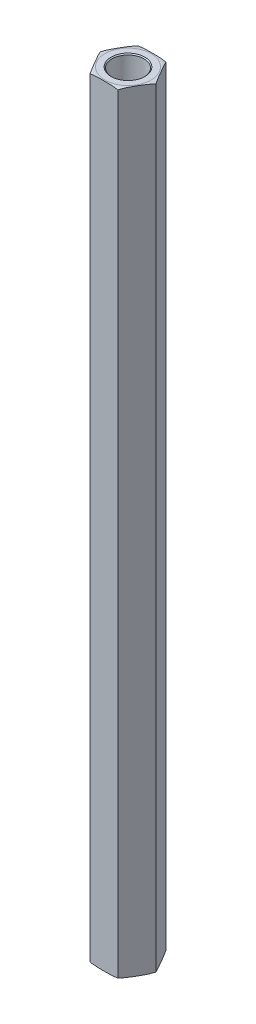
ISO-10303-21;
HEADER;
FILE_DESCRIPTION(('STEP AP214'),'2;1');
FILE_NAME('part.step','',(''),(''),'','','');
FILE_SCHEMA(('AUTOMOTIVE_DESIGN { 1 0 10303 214 1 1 1 1 }'));
ENDSEC;
DATA;
#1=APPLICATION_CONTEXT('core data for automotive mechanical design processes');
#2=APPLICATION_PROTOCOL_DEFINITION('international standard','automotive_design',2000,#1);
#3=PRODUCT_CONTEXT('',#1,'mechanical');
#4=PRODUCT('Part','Part','',(#3));
#5=PRODUCT_RELATED_PRODUCT_CATEGORY('part','',(#4));
#6=PRODUCT_DEFINITION_FORMATION('','',#4);
#7=PRODUCT_DEFINITION_CONTEXT('part definition',#1,'design');
#8=PRODUCT_DEFINITION('design','',#6,#7);
#9=PRODUCT_DEFINITION_SHAPE('','',#8);
#10=(LENGTH_UNIT() NAMED_UNIT(*) SI_UNIT(.MILLI.,.METRE.));
#11=(NAMED_UNIT(*) PLANE_ANGLE_UNIT() SI_UNIT($,.RADIAN.));
#12=(NAMED_UNIT(*) SI_UNIT($,.STERADIAN.) SOLID_ANGLE_UNIT());
#13=UNCERTAINTY_MEASURE_WITH_UNIT(LENGTH_MEASURE(1.E-05),#10,'distance_accuracy_value','');
#14=(GEOMETRIC_REPRESENTATION_CONTEXT(3) GLOBAL_UNCERTAINTY_ASSIGNED_CONTEXT((#13)) GLOBAL_UNIT_ASSIGNED_CONTEXT((#10,
#11,#12)) REPRESENTATION_CONTEXT('',''));
#15=CARTESIAN_POINT('',(0.,0.,0.));
#16=DIRECTION('',(0.,0.,1.));
#17=DIRECTION('',(1.,0.,0.));
#18=AXIS2_PLACEMENT_3D('',#15,#16,#17);
#19=CARTESIAN_POINT('',(0.,38.1,0.));
#20=DIRECTION('',(0.,1.,0.));
#21=DIRECTION('',(0.,0.,1.));
#22=AXIS2_PLACEMENT_3D('',#19,#20,#21);
#23=PLANE('',#22);
#24=CARTESIAN_POINT('',(0.,38.1,0.));
#25=DIRECTION('',(0.,1.,0.));
#26=DIRECTION('',(0.,0.,1.));
#27=AXIS2_PLACEMENT_3D('',#24,#25,#26);
#28=CIRCLE('',#27,2.0955);
#29=CARTESIAN_POINT('',(0.,38.1,2.0955));
#30=VERTEX_POINT('',#29);
#31=EDGE_CURVE('E278',#30,#30,#28,.T.);
#32=ORIENTED_EDGE('',*,*,#31,.T.);
#33=EDGE_LOOP('',(#32));
#34=FACE_BOUND('',#33,.T.);
#35=ADVANCED_FACE('F14',(#34),#23,.T.);
#36=CARTESIAN_POINT('',(0.,-38.1,0.));
#37=DIRECTION('',(0.,-1.,0.));
#38=DIRECTION('',(0.,0.,-1.));
#39=AXIS2_PLACEMENT_3D('',#36,#37,#38);
#40=PLANE('',#39);
#41=CARTESIAN_POINT('',(0.,-38.1,0.));
#42=DIRECTION('',(0.,-1.,0.));
#43=DIRECTION('',(0.,0.,-1.));
#44=AXIS2_PLACEMENT_3D('',#41,#42,#43);
#45=CIRCLE('',#44,2.0955);
#46=CARTESIAN_POINT('',(0.,-38.1,-2.0955));
#47=VERTEX_POINT('',#46);
#48=EDGE_CURVE('E401',#47,#47,#45,.T.);
#49=ORIENTED_EDGE('',*,*,#48,.T.);
#50=EDGE_LOOP('',(#49));
#51=FACE_BOUND('',#50,.T.);
#52=ADVANCED_FACE('F381',(#51),#40,.T.);
#53=CARTESIAN_POINT('',(0.,38.1,0.));
#54=DIRECTION('',(0.,1.,0.));
#55=DIRECTION('',(0.,0.,1.));
#56=AXIS2_PLACEMENT_3D('',#53,#54,#55);
#57=CYLINDRICAL_SURFACE('',#56,2.0955);
#58=CARTESIAN_POINT('',(0.,50.6729999999607,0.));
#59=DIRECTION('',(0.,1.,0.));
#60=DIRECTION('',(0.,0.,1.));
#61=AXIS2_PLACEMENT_3D('',#58,#59,#60);
#62=CIRCLE('',#61,2.09549999999581);
#63=CARTESIAN_POINT('',(0.,50.6729999999607,2.09549999999581));
#64=VERTEX_POINT('',#63);
#65=EDGE_CURVE('E403',#64,#64,#62,.T.);
#66=ORIENTED_EDGE('',*,*,#65,.T.);
#67=EDGE_LOOP('',(#66));
#68=FACE_BOUND('',#67,.T.);
#69=ORIENTED_EDGE('',*,*,#31,.F.);
#70=EDGE_LOOP('',(#69));
#71=FACE_BOUND('',#70,.T.);
#72=ADVANCED_FACE('F373',(#68,#71),#57,.F.);
#73=CARTESIAN_POINT('',(0.,-38.1,0.));
#74=DIRECTION('',(0.,-1.,0.));
#75=DIRECTION('',(0.,0.,-1.));
#76=AXIS2_PLACEMENT_3D('',#73,#74,#75);
#77=CYLINDRICAL_SURFACE('',#76,2.0955);
#78=ORIENTED_EDGE('',*,*,#48,.F.);
#79=EDGE_LOOP('',(#78));
#80=FACE_BOUND('',#79,.T.);
#81=CARTESIAN_POINT('',(0.,-50.6729999999607,0.));
#82=DIRECTION('',(0.,-1.,0.));
#83=DIRECTION('',(0.,0.,-1.));
#84=AXIS2_PLACEMENT_3D('',#81,#82,#83);
#85=CIRCLE('',#84,2.09550000005265);
#86=CARTESIAN_POINT('',(0.,-50.6729999999607,-2.09550000005265));
#87=VERTEX_POINT('',#86);
#88=EDGE_CURVE('E91',#87,#87,#85,.T.);
#89=ORIENTED_EDGE('',*,*,#88,.T.);
#90=EDGE_LOOP('',(#89));
#91=FACE_BOUND('',#90,.T.);
#92=ADVANCED_FACE('F365',(#80,#91),#77,.F.);
#93=CARTESIAN_POINT('',(0.,50.7999999999811,0.));
#94=DIRECTION('',(0.,1.,0.));
#95=DIRECTION('',(0.,0.,1.));
#96=AXIS2_PLACEMENT_3D('',#93,#94,#95);
#97=CONICAL_SURFACE('',#96,2.22249999995938,0.785398163173655);
#98=CARTESIAN_POINT('',(0.,50.7999999999811,0.));
#99=DIRECTION('',(0.,1.,0.));
#100=DIRECTION('',(0.,0.,1.));
#101=AXIS2_PLACEMENT_3D('',#98,#99,#100);
#102=CIRCLE('',#101,2.22249999995938);
#103=CARTESIAN_POINT('',(0.,50.7999999999811,2.22249999995938));
#104=VERTEX_POINT('',#103);
#105=EDGE_CURVE('E137',#104,#104,#102,.T.);
#106=ORIENTED_EDGE('',*,*,#105,.T.);
#107=EDGE_LOOP('',(#106));
#108=FACE_BOUND('',#107,.T.);
#109=ORIENTED_EDGE('',*,*,#65,.F.);
#110=EDGE_LOOP('',(#109));
#111=FACE_BOUND('',#110,.T.);
#112=ADVANCED_FACE('F358',(#108,#111),#97,.F.);
#113=CARTESIAN_POINT('',(0.,-50.7999999999242,0.));
#114=DIRECTION('',(0.,-1.,0.));
#115=DIRECTION('',(1.,0.,0.));
#116=AXIS2_PLACEMENT_3D('',#113,#114,#115);
#117=CONICAL_SURFACE('',#116,2.22249999995938,0.785398163397448);
#118=ORIENTED_EDGE('',*,*,#88,.F.);
#119=EDGE_LOOP('',(#118));
#120=FACE_BOUND('',#119,.T.);
#121=CARTESIAN_POINT('',(0.,-50.7999999999811,0.));
#122=DIRECTION('',(0.,-1.,0.));
#123=DIRECTION('',(1.,0.,0.));
#124=AXIS2_PLACEMENT_3D('',#121,#122,#123);
#125=CIRCLE('',#124,2.22250000001623);
#126=CARTESIAN_POINT('',(2.22250000001623,-50.7999999999811,0.));
#127=VERTEX_POINT('',#126);
#128=EDGE_CURVE('E141',#127,#127,#125,.F.);
#129=ORIENTED_EDGE('',*,*,#128,.F.);
#130=EDGE_LOOP('',(#129));
#131=FACE_BOUND('',#130,.T.);
#132=ADVANCED_FACE('F352',(#120,#131),#117,.F.);
#133=CARTESIAN_POINT('',(1.83308710467706,50.8,3.17499999999999));
#134=DIRECTION('',(-0.866025403784439,0.,-0.5));
#135=DIRECTION('',(-0.5,0.,0.866025403784439));
#136=AXIS2_PLACEMENT_3D('',#133,#134,#135);
#137=PLANE('',#136);
#138=DIRECTION('',(0.,1.,0.));
#139=VECTOR('',#138,1.);
#140=CARTESIAN_POINT('',(3.66617420935412,50.8,0.));
#141=LINE('',#140,#139);
#142=CARTESIAN_POINT('',(3.66617420935412,-50.673,0.));
#143=VERTEX_POINT('',#142);
#144=CARTESIAN_POINT('',(3.66617420935412,50.673,0.));
#145=VERTEX_POINT('',#144);
#146=EDGE_CURVE('E73',#143,#145,#141,.T.);
#147=ORIENTED_EDGE('',*,*,#146,.T.);
#148=CARTESIAN_POINT('',(1.83308710467706,50.673,3.17499999999999));
#149=CARTESIAN_POINT('',(1.87128169935724,50.6889014148997,3.10884502143943));
#150=CARTESIAN_POINT('',(1.90969320538961,50.7024886076105,3.04231434139612));
#151=CARTESIAN_POINT('',(1.98677079607407,50.7258161979402,2.90881203820563));
#152=CARTESIAN_POINT('',(2.02543658353272,50.7355604771397,2.8418409298126));
#153=CARTESIAN_POINT('',(2.10284499535245,50.7519966530451,2.70776562760761));
#154=CARTESIAN_POINT('',(2.14158731769806,50.7586945328669,2.64066195690181));
#155=CARTESIAN_POINT('',(2.21916296783005,50.7697767572932,2.50629698944301));
#156=CARTESIAN_POINT('',(2.25799631815347,50.774160450474,2.43903565365472));
#157=CARTESIAN_POINT('',(2.33572065438804,50.7812403004263,2.30441315431189));
#158=CARTESIAN_POINT('',(2.37461166028643,50.7839355237591,2.23705195613842));
#159=CARTESIAN_POINT('',(2.45240986808526,50.7881531983713,2.10230150749304));
#160=CARTESIAN_POINT('',(2.49131707051149,50.7896756080272,2.03491225611043));
#161=CARTESIAN_POINT('',(2.56874613804246,50.791922705889,1.90080117716412));
#162=CARTESIAN_POINT('',(2.60726795154184,50.7926552468181,1.83407943898349));
#163=CARTESIAN_POINT('',(2.68431353056975,50.7935767302574,1.70063258160859));
#164=CARTESIAN_POINT('',(2.7228372961168,50.7937656658949,1.63390746238224));
#165=CARTESIAN_POINT('',(2.79990166972107,50.7936659966806,1.50042805184618));
#166=CARTESIAN_POINT('',(2.83844227771298,50.7933771811766,1.43367376064959));
#167=CARTESIAN_POINT('',(2.91552223317789,50.792221986219,1.30016736153921));
#168=CARTESIAN_POINT('',(2.95406158061874,50.7913555970386,1.23341525368111));
#169=CARTESIAN_POINT('',(3.03113161773349,50.7887861940656,1.09992603365715));
#170=CARTESIAN_POINT('',(3.06966230777154,50.7870832271616,1.03318892086055));
#171=CARTESIAN_POINT('',(3.14670480062211,50.7824387229726,0.899747408901609));
#172=CARTESIAN_POINT('',(3.18521660427677,50.7794972471358,0.833043008280623));
#173=CARTESIAN_POINT('',(3.24841925163174,50.7732174124749,0.723572811888941));
#174=CARTESIAN_POINT('',(3.27312282066109,50.7703980110463,0.680784975201828));
#175=CARTESIAN_POINT('',(3.32249186130891,50.7638696794304,0.595275288478872));
#176=CARTESIAN_POINT('',(3.34715734368935,50.7601610809139,0.552553419802749));
#177=CARTESIAN_POINT('',(3.39643377591423,50.7516802711497,0.467204135573543));
#178=CARTESIAN_POINT('',(3.4210447429559,50.7469084657008,0.42457669023397));
#179=CARTESIAN_POINT('',(3.47026036719569,50.7360987712516,0.339332728524432));
#180=CARTESIAN_POINT('',(3.49486485317655,50.7300577313084,0.296716508711463));
#181=CARTESIAN_POINT('',(3.54398805502185,50.7165138354161,0.211632627284945));
#182=CARTESIAN_POINT('',(3.56850671785504,50.709010197803,0.169165057524206));
#183=CARTESIAN_POINT('',(3.61743974029947,50.6923203507084,0.0844105764825505));
#184=CARTESIAN_POINT('',(3.64185387349848,50.6831314978033,0.0421240573591034));
#185=CARTESIAN_POINT('',(3.66617420935412,50.673,0.));
#186=B_SPLINE_CURVE_WITH_KNOTS('',3,(#148,#149,#150,#151,#152,#153,#154,#155,#156,#157,#158,
#159,#160,#161,#162,#163,#164,#165,#166,#167,#168,#169,#170,#171,#172,#173,#174,#175,#176,#177,
#178,#179,#180,#181,#182,#183,#184,#185),.UNSPECIFIED.,.F.,.F.,(4,2,2,2,2,2,2,2,2,2,2,2,2,2,2,2,
2,2,4),(0.,0.233977307817942,0.467717675040695,0.700996973557503,0.934341903229754,
1.1678157196724,1.40129782179825,1.6324366580967,1.86357841666618,2.09482211846295,
2.32606971471496,2.55730435147399,2.78852751694414,2.93698369265088,3.08538458004474,
3.23372892334585,3.38244598546612,3.53124274626083,3.68027493713584),.UNSPECIFIED.);
#187=CARTESIAN_POINT('',(1.83308710467706,50.673,3.17499999999999));
#188=VERTEX_POINT('',#187);
#189=EDGE_CURVE('E97',#188,#145,#186,.T.);
#190=ORIENTED_EDGE('',*,*,#189,.F.);
#191=DIRECTION('',(0.,1.,0.));
#192=VECTOR('',#191,1.);
#193=CARTESIAN_POINT('',(1.83308710467706,50.8,3.17499999999999));
#194=LINE('',#193,#192);
#195=CARTESIAN_POINT('',(1.83308710467706,-50.673,3.17499999999999));
#196=VERTEX_POINT('',#195);
#197=EDGE_CURVE('E90',#188,#196,#194,.F.);
#198=ORIENTED_EDGE('',*,*,#197,.T.);
#199=CARTESIAN_POINT('',(3.66617420935412,-50.673,0.));
#200=CARTESIAN_POINT('',(3.62797961467395,-50.6889014148997,0.0661549785605619));
#201=CARTESIAN_POINT('',(3.58956810864157,-50.7024886076105,0.132685658603879));
#202=CARTESIAN_POINT('',(3.51249051795711,-50.7258161979402,0.266187961794363));
#203=CARTESIAN_POINT('',(3.47382473049846,-50.7355604771397,0.333159070187395));
#204=CARTESIAN_POINT('',(3.39641631867873,-50.7519966530451,0.467234372392387));
#205=CARTESIAN_POINT('',(3.35767399633312,-50.7586945328669,0.534338043098191));
#206=CARTESIAN_POINT('',(3.28009834620113,-50.7697767572932,0.66870301055699));
#207=CARTESIAN_POINT('',(3.24126499587771,-50.774160450474,0.735964346345277));
#208=CARTESIAN_POINT('',(3.16354065964314,-50.7812403004263,0.870586845688108));
#209=CARTESIAN_POINT('',(3.12464965374475,-50.7839355237591,0.93794804386158));
#210=CARTESIAN_POINT('',(3.04685144594592,-50.7881531983713,1.07269849250696));
#211=CARTESIAN_POINT('',(3.00794424351969,-50.7896756080272,1.14008774388956));
#212=CARTESIAN_POINT('',(2.93051517598872,-50.791922705889,1.27419882283587));
#213=CARTESIAN_POINT('',(2.89199336248934,-50.7926552468181,1.3409205610165));
#214=CARTESIAN_POINT('',(2.81494778346143,-50.7935767302574,1.47436741839141));
#215=CARTESIAN_POINT('',(2.77642401791438,-50.7937656658949,1.54109253761776));
#216=CARTESIAN_POINT('',(2.69935964431012,-50.7936659966806,1.67457194815382));
#217=CARTESIAN_POINT('',(2.6608190363182,-50.7933771811766,1.74132623935041));
#218=CARTESIAN_POINT('',(2.58373908085329,-50.792221986219,1.87483263846079));
#219=CARTESIAN_POINT('',(2.54519973341244,-50.7913555970386,1.94158474631888));
#220=CARTESIAN_POINT('',(2.4681296962977,-50.7887861940656,2.07507396634284));
#221=CARTESIAN_POINT('',(2.42959900625964,-50.7870832271616,2.14181107913944));
#222=CARTESIAN_POINT('',(2.35255651340907,-50.7824387229726,2.27525259109839));
#223=CARTESIAN_POINT('',(2.31404470975441,-50.7794972471358,2.34195699171937));
#224=CARTESIAN_POINT('',(2.25084206239943,-50.7732174124749,2.45142718811105));
#225=CARTESIAN_POINT('',(2.22613849337009,-50.7703980110463,2.49421502479817));
#226=CARTESIAN_POINT('',(2.17676945272227,-50.7638696794304,2.57972471152112));
#227=CARTESIAN_POINT('',(2.15210397034183,-50.7601610809139,2.62244658019725));
#228=CARTESIAN_POINT('',(2.10282753811695,-50.7516802711497,2.70779586442645));
#229=CARTESIAN_POINT('',(2.07821657107528,-50.7469084657008,2.75042330976603));
#230=CARTESIAN_POINT('',(2.02900094683549,-50.7360987712516,2.83566727147556));
#231=CARTESIAN_POINT('',(2.00439646085463,-50.7300577313084,2.87828349128853));
#232=CARTESIAN_POINT('',(1.95527325900933,-50.7165138354161,2.96336737271505));
#233=CARTESIAN_POINT('',(1.93075459617614,-50.709010197803,3.00583494247579));
#234=CARTESIAN_POINT('',(1.88182157373171,-50.6923203507084,3.09058942351745));
#235=CARTESIAN_POINT('',(1.8574074405327,-50.6831314978033,3.13287594264089));
#236=CARTESIAN_POINT('',(1.83308710467706,-50.673,3.17499999999999));
#237=B_SPLINE_CURVE_WITH_KNOTS('',3,(#199,#200,#201,#202,#203,#204,#205,#206,#207,#208,#209,
#210,#211,#212,#213,#214,#215,#216,#217,#218,#219,#220,#221,#222,#223,#224,#225,#226,#227,#228,
#229,#230,#231,#232,#233,#234,#235,#236),.UNSPECIFIED.,.F.,.F.,(4,2,2,2,2,2,2,2,2,2,2,2,2,2,2,2,
2,2,4),(0.,0.233977307817943,0.467717675040696,0.700996973557504,0.934341903229755,
1.1678157196724,1.40129782179825,1.6324366580967,1.86357841666618,2.09482211846295,
2.32606971471496,2.55730435147399,2.78852751694414,2.93698369265088,3.08538458004474,
3.23372892334585,3.38244598546612,3.53124274626083,3.68027493713584),.UNSPECIFIED.);
#238=EDGE_CURVE('E84',#143,#196,#237,.T.);
#239=ORIENTED_EDGE('',*,*,#238,.F.);
#240=EDGE_LOOP('',(#147,#190,#198,#239));
#241=FACE_BOUND('',#240,.T.);
#242=ADVANCED_FACE('F88',(#241),#137,.F.);
#243=CARTESIAN_POINT('',(3.66617420935412,50.8,0.));
#244=DIRECTION('',(-0.866025403784439,0.,0.5));
#245=DIRECTION('',(0.5,0.,0.866025403784439));
#246=AXIS2_PLACEMENT_3D('',#243,#244,#245);
#247=PLANE('',#246);
#248=DIRECTION('',(0.,1.,0.));
#249=VECTOR('',#248,1.);
#250=CARTESIAN_POINT('',(1.83308710467706,50.8,-3.175));
#251=LINE('',#250,#249);
#252=CARTESIAN_POINT('',(1.83308710467706,-50.673,-3.175));
#253=VERTEX_POINT('',#252);
#254=CARTESIAN_POINT('',(1.83308710467706,50.673,-3.175));
#255=VERTEX_POINT('',#254);
#256=EDGE_CURVE('E153',#253,#255,#251,.T.);
#257=ORIENTED_EDGE('',*,*,#256,.T.);
#258=CARTESIAN_POINT('',(3.66617420935412,50.673,0.));
#259=CARTESIAN_POINT('',(3.62797961467395,50.6889014148997,-0.0661549785605564));
#260=CARTESIAN_POINT('',(3.58956810864157,50.7024886076105,-0.132685658603873));
#261=CARTESIAN_POINT('',(3.51249051795711,50.7258161979402,-0.266187961794358));
#262=CARTESIAN_POINT('',(3.47382473049846,50.7355604771397,-0.333159070187389));
#263=CARTESIAN_POINT('',(3.39641631867873,50.7519966530451,-0.467234372392381));
#264=CARTESIAN_POINT('',(3.35767399633312,50.7586945328669,-0.534338043098185));
#265=CARTESIAN_POINT('',(3.28009834620113,50.7697767572932,-0.668703010556983));
#266=CARTESIAN_POINT('',(3.24126499587771,50.774160450474,-0.735964346345271));
#267=CARTESIAN_POINT('',(3.16354065964315,50.7812403004263,-0.870586845688102));
#268=CARTESIAN_POINT('',(3.12464965374476,50.7839355237591,-0.937948043861573));
#269=CARTESIAN_POINT('',(3.04685144594592,50.7881531983713,-1.07269849250695));
#270=CARTESIAN_POINT('',(3.00794424351969,50.7896756080272,-1.14008774388956));
#271=CARTESIAN_POINT('',(2.93051517598873,50.791922705889,-1.27419882283586));
#272=CARTESIAN_POINT('',(2.89199336248934,50.7926552468181,-1.3409205610165));
#273=CARTESIAN_POINT('',(2.81494778346143,50.7935767302574,-1.4743674183914));
#274=CARTESIAN_POINT('',(2.77642401791439,50.7937656658949,-1.54109253761775));
#275=CARTESIAN_POINT('',(2.69935964431012,50.7936659966806,-1.67457194815381));
#276=CARTESIAN_POINT('',(2.66081903631821,50.7933771811766,-1.7413262393504));
#277=CARTESIAN_POINT('',(2.58373908085329,50.792221986219,-1.87483263846078));
#278=CARTESIAN_POINT('',(2.54519973341245,50.7913555970386,-1.94158474631887));
#279=CARTESIAN_POINT('',(2.4681296962977,50.7887861940656,-2.07507396634283));
#280=CARTESIAN_POINT('',(2.42959900625964,50.7870832271616,-2.14181107913944));
#281=CARTESIAN_POINT('',(2.35255651340908,50.7824387229726,-2.27525259109838));
#282=CARTESIAN_POINT('',(2.31404470975442,50.7794972471358,-2.34195699171936));
#283=CARTESIAN_POINT('',(2.25084206239944,50.7732174124749,-2.45142718811105));
#284=CARTESIAN_POINT('',(2.22613849337009,50.7703980110463,-2.49421502479816));
#285=CARTESIAN_POINT('',(2.17676945272227,50.7638696794304,-2.57972471152112));
#286=CARTESIAN_POINT('',(2.15210397034183,50.7601610809139,-2.62244658019724));
#287=CARTESIAN_POINT('',(2.10282753811695,50.7516802711497,-2.70779586442645));
#288=CARTESIAN_POINT('',(2.07821657107528,50.7469084657008,-2.75042330976602));
#289=CARTESIAN_POINT('',(2.02900094683549,50.7360987712516,-2.83566727147556));
#290=CARTESIAN_POINT('',(2.00439646085463,50.7300577313084,-2.87828349128853));
#291=CARTESIAN_POINT('',(1.95527325900933,50.7165138354161,-2.96336737271505));
#292=CARTESIAN_POINT('',(1.93075459617614,50.709010197803,-3.00583494247579));
#293=CARTESIAN_POINT('',(1.88182157373171,50.6923203507084,-3.09058942351745));
#294=CARTESIAN_POINT('',(1.85740744053269,50.6831314978033,-3.1328759426409));
#295=CARTESIAN_POINT('',(1.83308710467706,50.673,-3.175));
#296=B_SPLINE_CURVE_WITH_KNOTS('',3,(#258,#259,#260,#261,#262,#263,#264,#265,#266,#267,#268,
#269,#270,#271,#272,#273,#274,#275,#276,#277,#278,#279,#280,#281,#282,#283,#284,#285,#286,#287,
#288,#289,#290,#291,#292,#293,#294,#295),.UNSPECIFIED.,.F.,.F.,(4,2,2,2,2,2,2,2,2,2,2,2,2,2,2,2,
2,2,4),(0.,0.233977307817942,0.467717675040695,0.700996973557502,0.934341903229753,
1.1678157196724,1.40129782179825,1.6324366580967,1.86357841666617,2.09482211846295,
2.32606971471495,2.55730435147398,2.78852751694414,2.93698369265088,3.08538458004474,
3.23372892334585,3.38244598546613,3.53124274626085,3.68027493713586),.UNSPECIFIED.);
#297=EDGE_CURVE('E81',#145,#255,#296,.T.);
#298=ORIENTED_EDGE('',*,*,#297,.F.);
#299=ORIENTED_EDGE('',*,*,#146,.F.);
#300=CARTESIAN_POINT('',(1.83308710467706,-50.673,-3.175));
#301=CARTESIAN_POINT('',(1.87128169935723,-50.6889014148997,-3.10884502143944));
#302=CARTESIAN_POINT('',(1.90969320538961,-50.7024886076105,-3.04231434139612));
#303=CARTESIAN_POINT('',(1.98677079607407,-50.7258161979402,-2.90881203820564));
#304=CARTESIAN_POINT('',(2.02543658353271,-50.7355604771397,-2.84184092981261));
#305=CARTESIAN_POINT('',(2.10284499535245,-50.7519966530451,-2.70776562760761));
#306=CARTESIAN_POINT('',(2.14158731769805,-50.7586945328669,-2.64066195690181));
#307=CARTESIAN_POINT('',(2.21916296783005,-50.7697767572932,-2.50629698944301));
#308=CARTESIAN_POINT('',(2.25799631815347,-50.774160450474,-2.43903565365473));
#309=CARTESIAN_POINT('',(2.33572065438803,-50.7812403004263,-2.3044131543119));
#310=CARTESIAN_POINT('',(2.37461166028642,-50.7839355237591,-2.23705195613842));
#311=CARTESIAN_POINT('',(2.45240986808525,-50.7881531983713,-2.10230150749305));
#312=CARTESIAN_POINT('',(2.49131707051149,-50.7896756080272,-2.03491225611044));
#313=CARTESIAN_POINT('',(2.56874613804245,-50.791922705889,-1.90080117716413));
#314=CARTESIAN_POINT('',(2.60726795154184,-50.7926552468181,-1.8340794389835));
#315=CARTESIAN_POINT('',(2.68431353056974,-50.7935767302574,-1.7006325816086));
#316=CARTESIAN_POINT('',(2.72283729611679,-50.7937656658949,-1.63390746238225));
#317=CARTESIAN_POINT('',(2.79990166972106,-50.7936659966806,-1.50042805184619));
#318=CARTESIAN_POINT('',(2.83844227771297,-50.7933771811766,-1.4336737606496));
#319=CARTESIAN_POINT('',(2.91552223317788,-50.792221986219,-1.30016736153922));
#320=CARTESIAN_POINT('',(2.95406158061873,-50.7913555970386,-1.23341525368113));
#321=CARTESIAN_POINT('',(3.03113161773347,-50.7887861940656,-1.09992603365717));
#322=CARTESIAN_POINT('',(3.06966230777153,-50.7870832271616,-1.03318892086057));
#323=CARTESIAN_POINT('',(3.1467048006221,-50.7824387229726,-0.899747408901624));
#324=CARTESIAN_POINT('',(3.18521660427676,-50.7794972471358,-0.833043008280638));
#325=CARTESIAN_POINT('',(3.24841925163173,-50.7732174124749,-0.723572811888955));
#326=CARTESIAN_POINT('',(3.27312282066108,-50.7703980110463,-0.680784975201841));
#327=CARTESIAN_POINT('',(3.3224918613089,-50.7638696794304,-0.595275288478882));
#328=CARTESIAN_POINT('',(3.34715734368935,-50.7601610809139,-0.552553419802759));
#329=CARTESIAN_POINT('',(3.39643377591422,-50.7516802711497,-0.46720413557355));
#330=CARTESIAN_POINT('',(3.42104474295589,-50.7469084657008,-0.424576690233976));
#331=CARTESIAN_POINT('',(3.47026036719568,-50.7360987712516,-0.339332728524436));
#332=CARTESIAN_POINT('',(3.49486485317655,-50.7300577313084,-0.296716508711466));
#333=CARTESIAN_POINT('',(3.54398805502185,-50.7165138354161,-0.211632627284946));
#334=CARTESIAN_POINT('',(3.56850671785504,-50.709010197803,-0.169165057524206));
#335=CARTESIAN_POINT('',(3.61743974029947,-50.6923203507084,-0.0844105764825478));
#336=CARTESIAN_POINT('',(3.64185387349848,-50.6831314978033,-0.0421240573590996));
#337=CARTESIAN_POINT('',(3.66617420935412,-50.673,0.));
#338=B_SPLINE_CURVE_WITH_KNOTS('',3,(#300,#301,#302,#303,#304,#305,#306,#307,#308,#309,#310,
#311,#312,#313,#314,#315,#316,#317,#318,#319,#320,#321,#322,#323,#324,#325,#326,#327,#328,#329,
#330,#331,#332,#333,#334,#335,#336,#337),.UNSPECIFIED.,.F.,.F.,(4,2,2,2,2,2,2,2,2,2,2,2,2,2,2,2,
2,2,4),(0.,0.233977307817942,0.467717675040694,0.700996973557501,0.93434190322975,
1.1678157196724,1.40129782179824,1.63243665809669,1.86357841666617,2.09482211846294,
2.32606971471495,2.55730435147397,2.78852751694413,2.93698369265087,3.08538458004473,
3.23372892334584,3.38244598546612,3.53124274626084,3.68027493713585),.UNSPECIFIED.);
#339=EDGE_CURVE('E78',#253,#143,#338,.T.);
#340=ORIENTED_EDGE('',*,*,#339,.F.);
#341=EDGE_LOOP('',(#257,#298,#299,#340));
#342=FACE_BOUND('',#341,.T.);
#343=ADVANCED_FACE('F76',(#342),#247,.F.);
#344=CARTESIAN_POINT('',(-1.83308710467707,50.8,-3.175));
#345=DIRECTION('',(0.,-1.,0.));
#346=DIRECTION('',(0.,0.,-1.));
#347=AXIS2_PLACEMENT_3D('',#344,#345,#346);
#348=PLANE('',#347);
#349=CARTESIAN_POINT('',(0.,50.8,0.));
#350=DIRECTION('',(0.,-1.,0.));
#351=DIRECTION('',(0.,0.,1.));
#352=AXIS2_PLACEMENT_3D('',#349,#350,#351);
#353=CIRCLE('',#352,3.03117420935412);
#354=CARTESIAN_POINT('',(0.,50.8,3.03117420935412));
#355=VERTEX_POINT('',#354);
#356=CARTESIAN_POINT('',(0.,50.8,-3.03117420935412));
#357=VERTEX_POINT('',#356);
#358=EDGE_CURVE('E217',#355,#357,#353,.T.);
#359=ORIENTED_EDGE('',*,*,#358,.F.);
#360=CARTESIAN_POINT('',(0.,50.8,0.));
#361=DIRECTION('',(0.,-1.,0.));
#362=DIRECTION('',(0.,0.,-1.));
#363=AXIS2_PLACEMENT_3D('',#360,#361,#362);
#364=CIRCLE('',#363,3.03117420935412);
#365=EDGE_CURVE('E140',#357,#355,#364,.T.);
#366=ORIENTED_EDGE('',*,*,#365,.F.);
#367=EDGE_LOOP('',(#359,#366));
#368=FACE_BOUND('',#367,.T.);
#369=ORIENTED_EDGE('',*,*,#105,.F.);
#370=EDGE_LOOP('',(#369));
#371=FACE_BOUND('',#370,.T.);
#372=ADVANCED_FACE('F129',(#368,#371),#348,.F.);
#373=CARTESIAN_POINT('',(-1.83308710467707,-50.8,-3.175));
#374=DIRECTION('',(0.,-1.,0.));
#375=DIRECTION('',(0.,0.,-1.));
#376=AXIS2_PLACEMENT_3D('',#373,#374,#375);
#377=PLANE('',#376);
#378=CARTESIAN_POINT('',(0.,-50.8,0.));
#379=DIRECTION('',(0.,1.,0.));
#380=DIRECTION('',(0.,0.,1.));
#381=AXIS2_PLACEMENT_3D('',#378,#379,#380);
#382=CIRCLE('',#381,3.03117420935412);
#383=CARTESIAN_POINT('',(0.,-50.8,-3.03117420935412));
#384=VERTEX_POINT('',#383);
#385=CARTESIAN_POINT('',(0.,-50.8,3.03117420935412));
#386=VERTEX_POINT('',#385);
#387=EDGE_CURVE('E144',#384,#386,#382,.F.);
#388=ORIENTED_EDGE('',*,*,#387,.T.);
#389=CARTESIAN_POINT('',(0.,-50.8,0.));
#390=DIRECTION('',(0.,1.,0.));
#391=DIRECTION('',(0.,0.,-1.));
#392=AXIS2_PLACEMENT_3D('',#389,#390,#391);
#393=CIRCLE('',#392,3.03117420935412);
#394=EDGE_CURVE('E212',#384,#386,#393,.T.);
#395=ORIENTED_EDGE('',*,*,#394,.F.);
#396=EDGE_LOOP('',(#388,#395));
#397=FACE_BOUND('',#396,.T.);
#398=ORIENTED_EDGE('',*,*,#128,.T.);
#399=EDGE_LOOP('',(#398));
#400=FACE_BOUND('',#399,.T.);
#401=ADVANCED_FACE('F233',(#397,#400),#377,.T.);
#402=CARTESIAN_POINT('',(-1.83308710467707,50.8,3.175));
#403=DIRECTION('',(0.,0.,-1.));
#404=DIRECTION('',(-1.,0.,0.));
#405=AXIS2_PLACEMENT_3D('',#402,#403,#404);
#406=PLANE('',#405);
#407=ORIENTED_EDGE('',*,*,#197,.F.);
#408=CARTESIAN_POINT('',(-1.83308710467706,50.673,3.175));
#409=CARTESIAN_POINT('',(-1.73237579828684,50.6939400141518,3.175));
#410=CARTESIAN_POINT('',(-1.63096506893486,50.7108853495327,3.175));
#411=CARTESIAN_POINT('',(-1.42767146651469,50.7384971643984,3.175));
#412=CARTESIAN_POINT('',(-1.32579191427254,50.7491875658753,3.175));
#413=CARTESIAN_POINT('',(-1.12177634709138,50.7661280408079,3.175));
#414=CARTESIAN_POINT('',(-1.0196405664338,50.7723812707189,3.175));
#415=CARTESIAN_POINT('',(-0.815663681397378,50.7819028064183,3.175));
#416=CARTESIAN_POINT('',(-0.713823115514575,50.7851834044999,3.175));
#417=CARTESIAN_POINT('',(-0.510018485441652,50.7899454848703,3.175));
#418=CARTESIAN_POINT('',(-0.408054390577978,50.7914254100882,3.175));
#419=CARTESIAN_POINT('',(-0.204060200337871,50.7933146818379,3.175));
#420=CARTESIAN_POINT('',(-0.102030100168935,50.7937234241492,3.175));
#421=CARTESIAN_POINT('',(0.102030100168935,50.7937234241492,3.175));
#422=CARTESIAN_POINT('',(0.204060200337871,50.7933146818379,3.175));
#423=CARTESIAN_POINT('',(0.408054390577978,50.7914254100882,3.17499999999999));
#424=CARTESIAN_POINT('',(0.510018485441652,50.7899454848703,3.17499999999999));
#425=CARTESIAN_POINT('',(0.713823115514575,50.7851834044999,3.17499999999999));
#426=CARTESIAN_POINT('',(0.815663681397378,50.7819028064183,3.17499999999999));
#427=CARTESIAN_POINT('',(1.0196405664338,50.7723812707189,3.17499999999999));
#428=CARTESIAN_POINT('',(1.12177634709138,50.7661280408079,3.17499999999999));
#429=CARTESIAN_POINT('',(1.32579191427254,50.7491875658753,3.17499999999999));
#430=CARTESIAN_POINT('',(1.42767146651469,50.7384971643984,3.17499999999999));
#431=CARTESIAN_POINT('',(1.63096506893486,50.7108853495327,3.17499999999999));
#432=CARTESIAN_POINT('',(1.73237579828684,50.6939400141518,3.17499999999999));
#433=CARTESIAN_POINT('',(1.83308710467706,50.673,3.17499999999999));
#434=B_SPLINE_CURVE_WITH_KNOTS('',3,(#408,#409,#410,#411,#412,#413,#414,#415,#416,#417,#418,
#419,#420,#421,#422,#423,#424,#425,#426,#427,#428,#429,#430,#431,#432,#433),.UNSPECIFIED.,.F.,
.F.,(4,2,2,2,2,2,2,2,2,2,2,2,4),(0.,0.308333242342809,0.615479423308237,0.922406891130011,
1.2280592962085,1.53397581645216,1.84006485747889,2.14615389850562,2.45207041874928,
2.75772282382777,3.06465029164955,3.37179647261498,3.68012971495778),.UNSPECIFIED.);
#435=CARTESIAN_POINT('',(-1.83308710467706,50.673,3.175));
#436=VERTEX_POINT('',#435);
#437=EDGE_CURVE('E152',#436,#188,#434,.T.);
#438=ORIENTED_EDGE('',*,*,#437,.F.);
#439=DIRECTION('',(0.,1.,0.));
#440=VECTOR('',#439,1.);
#441=CARTESIAN_POINT('',(-1.83308710467707,50.8,3.175));
#442=LINE('',#441,#440);
#443=CARTESIAN_POINT('',(-1.83308710467707,-50.673,3.17499999999999));
#444=VERTEX_POINT('',#443);
#445=EDGE_CURVE('E175',#436,#444,#442,.F.);
#446=ORIENTED_EDGE('',*,*,#445,.T.);
#447=CARTESIAN_POINT('',(1.83308710467706,-50.673,3.17499999999999));
#448=CARTESIAN_POINT('',(1.73237579828684,-50.6939400141518,3.17499999999999));
#449=CARTESIAN_POINT('',(1.63096506893486,-50.7108853495327,3.17499999999999));
#450=CARTESIAN_POINT('',(1.42767146651469,-50.7384971643984,3.17499999999999));
#451=CARTESIAN_POINT('',(1.32579191427254,-50.7491875658753,3.17499999999999));
#452=CARTESIAN_POINT('',(1.12177634709138,-50.7661280408079,3.17499999999999));
#453=CARTESIAN_POINT('',(1.0196405664338,-50.7723812707189,3.17499999999999));
#454=CARTESIAN_POINT('',(0.815663681397379,-50.7819028064183,3.17499999999999));
#455=CARTESIAN_POINT('',(0.713823115514576,-50.7851834044999,3.17499999999999));
#456=CARTESIAN_POINT('',(0.510018485441653,-50.7899454848703,3.17499999999999));
#457=CARTESIAN_POINT('',(0.408054390577978,-50.7914254100882,3.17499999999999));
#458=CARTESIAN_POINT('',(0.204060200337871,-50.7933146818379,3.175));
#459=CARTESIAN_POINT('',(0.102030100168935,-50.7937234241492,3.175));
#460=CARTESIAN_POINT('',(-0.102030100168936,-50.7937234241492,3.175));
#461=CARTESIAN_POINT('',(-0.204060200337872,-50.7933146818379,3.175));
#462=CARTESIAN_POINT('',(-0.40805439057798,-50.7914254100882,3.175));
#463=CARTESIAN_POINT('',(-0.510018485441656,-50.7899454848703,3.175));
#464=CARTESIAN_POINT('',(-0.713823115514579,-50.7851834044999,3.175));
#465=CARTESIAN_POINT('',(-0.815663681397383,-50.7819028064183,3.175));
#466=CARTESIAN_POINT('',(-1.0196405664338,-50.7723812707189,3.175));
#467=CARTESIAN_POINT('',(-1.12177634709138,-50.7661280408079,3.175));
#468=CARTESIAN_POINT('',(-1.32579191427255,-50.7491875658753,3.175));
#469=CARTESIAN_POINT('',(-1.4276714665147,-50.7384971643984,3.175));
#470=CARTESIAN_POINT('',(-1.63096506893487,-50.7108853495327,3.175));
#471=CARTESIAN_POINT('',(-1.73237579828685,-50.6939400141518,3.175));
#472=CARTESIAN_POINT('',(-1.83308710467707,-50.673,3.175));
#473=B_SPLINE_CURVE_WITH_KNOTS('',3,(#447,#448,#449,#450,#451,#452,#453,#454,#455,#456,#457,
#458,#459,#460,#461,#462,#463,#464,#465,#466,#467,#468,#469,#470,#471,#472),.UNSPECIFIED.,.F.,
.F.,(4,2,2,2,2,2,2,2,2,2,2,2,4),(0.,0.308333242342809,0.615479423308238,0.922406891130012,
1.2280592962085,1.53397581645216,1.84006485747889,2.14615389850562,2.45207041874929,
2.75772282382778,3.06465029164956,3.37179647261499,3.6801297149578),.UNSPECIFIED.);
#474=EDGE_CURVE('E187',#196,#444,#473,.T.);
#475=ORIENTED_EDGE('',*,*,#474,.F.);
#476=EDGE_LOOP('',(#407,#438,#446,#475));
#477=FACE_BOUND('',#476,.T.);
#478=ADVANCED_FACE('F225',(#477),#406,.F.);
#479=CARTESIAN_POINT('',(1.83308710467706,50.8,-3.175));
#480=DIRECTION('',(0.,0.,1.));
#481=DIRECTION('',(1.,0.,0.));
#482=AXIS2_PLACEMENT_3D('',#479,#480,#481);
#483=PLANE('',#482);
#484=DIRECTION('',(0.,1.,0.));
#485=VECTOR('',#484,1.);
#486=CARTESIAN_POINT('',(-1.83308710467708,50.8,-3.17499999999999));
#487=LINE('',#486,#485);
#488=CARTESIAN_POINT('',(-1.83308710467708,-50.673,-3.175));
#489=VERTEX_POINT('',#488);
#490=CARTESIAN_POINT('',(-1.83308710467706,50.673,-3.17500000000001));
#491=VERTEX_POINT('',#490);
#492=EDGE_CURVE('E287',#489,#491,#487,.T.);
#493=ORIENTED_EDGE('',*,*,#492,.T.);
#494=CARTESIAN_POINT('',(1.83308710467706,50.673,-3.175));
#495=CARTESIAN_POINT('',(1.73237579828683,50.6939400141518,-3.175));
#496=CARTESIAN_POINT('',(1.63096506893486,50.7108853495327,-3.175));
#497=CARTESIAN_POINT('',(1.42767146651469,50.7384971643984,-3.175));
#498=CARTESIAN_POINT('',(1.32579191427254,50.7491875658753,-3.175));
#499=CARTESIAN_POINT('',(1.12177634709137,50.7661280408079,-3.175));
#500=CARTESIAN_POINT('',(1.0196405664338,50.7723812707189,-3.175));
#501=CARTESIAN_POINT('',(0.815663681397375,50.7819028064183,-3.175));
#502=CARTESIAN_POINT('',(0.713823115514573,50.7851834044999,-3.175));
#503=CARTESIAN_POINT('',(0.510018485441651,50.7899454848703,-3.175));
#504=CARTESIAN_POINT('',(0.408054390577976,50.7914254100882,-3.175));
#505=CARTESIAN_POINT('',(0.20406020033787,50.7933146818379,-3.175));
#506=CARTESIAN_POINT('',(0.102030100168935,50.7937234241492,-3.17500000000001));
#507=CARTESIAN_POINT('',(-0.102030100168934,50.7937234241492,-3.17500000000001));
#508=CARTESIAN_POINT('',(-0.204060200337869,50.7933146818379,-3.175));
#509=CARTESIAN_POINT('',(-0.408054390577975,50.7914254100882,-3.175));
#510=CARTESIAN_POINT('',(-0.510018485441649,50.7899454848703,-3.175));
#511=CARTESIAN_POINT('',(-0.71382311551457,50.7851834044999,-3.175));
#512=CARTESIAN_POINT('',(-0.815663681397373,50.7819028064183,-3.175));
#513=CARTESIAN_POINT('',(-1.01964056643379,50.7723812707189,-3.175));
#514=CARTESIAN_POINT('',(-1.12177634709137,50.7661280408079,-3.175));
#515=CARTESIAN_POINT('',(-1.32579191427253,50.7491875658753,-3.175));
#516=CARTESIAN_POINT('',(-1.42767146651469,50.7384971643984,-3.175));
#517=CARTESIAN_POINT('',(-1.63096506893485,50.7108853495327,-3.175));
#518=CARTESIAN_POINT('',(-1.73237579828682,50.6939400141518,-3.175));
#519=CARTESIAN_POINT('',(-1.83308710467705,50.673,-3.175));
#520=B_SPLINE_CURVE_WITH_KNOTS('',3,(#494,#495,#496,#497,#498,#499,#500,#501,#502,#503,#504,
#505,#506,#507,#508,#509,#510,#511,#512,#513,#514,#515,#516,#517,#518,#519),.UNSPECIFIED.,.F.,
.F.,(4,2,2,2,2,2,2,2,2,2,2,2,4),(0.,0.308333242342807,0.615479423308235,0.922406891130008,
1.2280592962085,1.53397581645216,1.84006485747889,2.14615389850561,2.45207041874927,
2.75772282382776,3.06465029164953,3.37179647261496,3.68012971495777),.UNSPECIFIED.);
#521=EDGE_CURVE('E145',#255,#491,#520,.T.);
#522=ORIENTED_EDGE('',*,*,#521,.F.);
#523=ORIENTED_EDGE('',*,*,#256,.F.);
#524=CARTESIAN_POINT('',(-1.83308710467708,-50.673,-3.17500000000001));
#525=CARTESIAN_POINT('',(-1.73237579828685,-50.6939400141518,-3.175));
#526=CARTESIAN_POINT('',(-1.63096506893488,-50.7108853495327,-3.175));
#527=CARTESIAN_POINT('',(-1.42767146651471,-50.7384971643984,-3.175));
#528=CARTESIAN_POINT('',(-1.32579191427255,-50.7491875658753,-3.175));
#529=CARTESIAN_POINT('',(-1.12177634709139,-50.7661280408079,-3.175));
#530=CARTESIAN_POINT('',(-1.01964056643381,-50.7723812707189,-3.175));
#531=CARTESIAN_POINT('',(-0.815663681397383,-50.7819028064183,-3.175));
#532=CARTESIAN_POINT('',(-0.713823115514579,-50.7851834044999,-3.175));
#533=CARTESIAN_POINT('',(-0.510018485441655,-50.7899454848703,-3.175));
#534=CARTESIAN_POINT('',(-0.40805439057798,-50.7914254100882,-3.175));
#535=CARTESIAN_POINT('',(-0.204060200337871,-50.7933146818379,-3.175));
#536=CARTESIAN_POINT('',(-0.102030100168935,-50.7937234241492,-3.17500000000001));
#537=CARTESIAN_POINT('',(0.102030100168936,-50.7937234241492,-3.17500000000001));
#538=CARTESIAN_POINT('',(0.204060200337872,-50.7933146818379,-3.175));
#539=CARTESIAN_POINT('',(0.408054390577978,-50.7914254100882,-3.175));
#540=CARTESIAN_POINT('',(0.510018485441653,-50.7899454848703,-3.175));
#541=CARTESIAN_POINT('',(0.713823115514575,-50.7851834044999,-3.175));
#542=CARTESIAN_POINT('',(0.815663681397378,-50.7819028064183,-3.175));
#543=CARTESIAN_POINT('',(1.0196405664338,-50.7723812707189,-3.175));
#544=CARTESIAN_POINT('',(1.12177634709138,-50.7661280408079,-3.175));
#545=CARTESIAN_POINT('',(1.32579191427254,-50.7491875658753,-3.175));
#546=CARTESIAN_POINT('',(1.42767146651469,-50.7384971643984,-3.175));
#547=CARTESIAN_POINT('',(1.63096506893486,-50.7108853495327,-3.175));
#548=CARTESIAN_POINT('',(1.73237579828684,-50.6939400141518,-3.175));
#549=CARTESIAN_POINT('',(1.83308710467706,-50.673,-3.175));
#550=B_SPLINE_CURVE_WITH_KNOTS('',3,(#524,#525,#526,#527,#528,#529,#530,#531,#532,#533,#534,
#535,#536,#537,#538,#539,#540,#541,#542,#543,#544,#545,#546,#547,#548,#549),.UNSPECIFIED.,.F.,
.F.,(4,2,2,2,2,2,2,2,2,2,2,2,4),(0.,0.30833324234281,0.615479423308243,0.922406891130019,
1.22805929620851,1.53397581645218,1.84006485747891,2.14615389850564,2.4520704187493,
2.75772282382779,3.06465029164956,3.37179647261499,3.6801297149578),.UNSPECIFIED.);
#551=EDGE_CURVE('E96',#489,#253,#550,.T.);
#552=ORIENTED_EDGE('',*,*,#551,.F.);
#553=EDGE_LOOP('',(#493,#522,#523,#552));
#554=FACE_BOUND('',#553,.T.);
#555=ADVANCED_FACE('F159',(#554),#483,.F.);
#556=CARTESIAN_POINT('',(0.,49.149,0.));
#557=DIRECTION('',(0.,1.,0.));
#558=DIRECTION('',(0.,0.,1.));
#559=AXIS2_PLACEMENT_3D('',#556,#557,#558);
#560=TOROIDAL_SURFACE('',#559,3.03117420935412,1.65099999999997);
#561=ORIENTED_EDGE('',*,*,#358,.T.);
#562=ORIENTED_EDGE('',*,*,#365,.T.);
#563=EDGE_LOOP('',(#561,#562));
#564=FACE_BOUND('',#563,.T.);
#565=ORIENTED_EDGE('',*,*,#437,.T.);
#566=ORIENTED_EDGE('',*,*,#189,.T.);
#567=ORIENTED_EDGE('',*,*,#297,.T.);
#568=ORIENTED_EDGE('',*,*,#521,.T.);
#569=CARTESIAN_POINT('',(-1.83308710467706,50.673,-3.17500000000001));
#570=CARTESIAN_POINT('',(-1.87128169935723,50.6889014148997,-3.10884502143946));
#571=CARTESIAN_POINT('',(-1.90969320538961,50.7024886076105,-3.04231434139614));
#572=CARTESIAN_POINT('',(-1.98677079607407,50.7258161979402,-2.90881203820566));
#573=CARTESIAN_POINT('',(-2.02543658353271,50.7355604771397,-2.84184092981263));
#574=CARTESIAN_POINT('',(-2.10284499535244,50.7519966530451,-2.70776562760764));
#575=CARTESIAN_POINT('',(-2.14158731769805,50.7586945328669,-2.64066195690184));
#576=CARTESIAN_POINT('',(-2.21916296783004,50.7697767572932,-2.50629698944305));
#577=CARTESIAN_POINT('',(-2.25799631815346,50.774160450474,-2.43903565365476));
#578=CARTESIAN_POINT('',(-2.33572065438802,50.7812403004263,-2.30441315431194));
#579=CARTESIAN_POINT('',(-2.37461166028641,50.7839355237591,-2.23705195613847));
#580=CARTESIAN_POINT('',(-2.45240986808524,50.7881531983713,-2.10230150749309));
#581=CARTESIAN_POINT('',(-2.49131707051147,50.7896756080272,-2.03491225611049));
#582=CARTESIAN_POINT('',(-2.56874613804243,50.791922705889,-1.90080117716418));
#583=CARTESIAN_POINT('',(-2.60726795154182,50.7926552468181,-1.83407943898355));
#584=CARTESIAN_POINT('',(-2.68431353056972,50.7935767302574,-1.70063258160866));
#585=CARTESIAN_POINT('',(-2.72283729611677,50.7937656658949,-1.63390746238231));
#586=CARTESIAN_POINT('',(-2.79990166972103,50.7936659966806,-1.50042805184625));
#587=CARTESIAN_POINT('',(-2.83844227771294,50.7933771811766,-1.43367376064966));
#588=CARTESIAN_POINT('',(-2.91552223317786,50.792221986219,-1.30016736153929));
#589=CARTESIAN_POINT('',(-2.9540615806187,50.7913555970386,-1.23341525368119));
#590=CARTESIAN_POINT('',(-3.03113161773345,50.7887861940656,-1.09992603365724));
#591=CARTESIAN_POINT('',(-3.0696623077715,50.7870832271616,-1.03318892086064));
#592=CARTESIAN_POINT('',(-3.14670480062206,50.7824387229726,-0.8997474089017));
#593=CARTESIAN_POINT('',(-3.18521660427672,50.7794972471358,-0.833043008280716));
#594=CARTESIAN_POINT('',(-3.2484192516317,50.7732174124749,-0.723572811889031));
#595=CARTESIAN_POINT('',(-3.27312282066105,50.7703980110463,-0.680784975201912));
#596=CARTESIAN_POINT('',(-3.32249186130888,50.7638696794304,-0.595275288478944));
#597=CARTESIAN_POINT('',(-3.34715734368932,50.7601610809139,-0.552553419802817));
#598=CARTESIAN_POINT('',(-3.3964337759142,50.7516802711497,-0.4672041355736));
#599=CARTESIAN_POINT('',(-3.42104474295588,50.7469084657008,-0.424576690234022));
#600=CARTESIAN_POINT('',(-3.47026036719567,50.7360987712516,-0.339332728524473));
#601=CARTESIAN_POINT('',(-3.49486485317654,50.7300577313084,-0.296716508711498));
#602=CARTESIAN_POINT('',(-3.54398805502184,50.7165138354161,-0.21163262728497));
#603=CARTESIAN_POINT('',(-3.56850671785504,50.709010197803,-0.169165057524226));
#604=CARTESIAN_POINT('',(-3.61743974029947,50.6923203507084,-0.0844105764825594));
#605=CARTESIAN_POINT('',(-3.64185387349849,50.6831314978033,-0.042124057359107));
#606=CARTESIAN_POINT('',(-3.66617420935413,50.673,0.));
#607=B_SPLINE_CURVE_WITH_KNOTS('',3,(#569,#570,#571,#572,#573,#574,#575,#576,#577,#578,#579,
#580,#581,#582,#583,#584,#585,#586,#587,#588,#589,#590,#591,#592,#593,#594,#595,#596,#597,#598,
#599,#600,#601,#602,#603,#604,#605,#606),.UNSPECIFIED.,.F.,.F.,(4,2,2,2,2,2,2,2,2,2,2,2,2,2,2,2,
2,2,4),(0.,0.233977307817937,0.467717675040683,0.700996973557482,0.934341903229726,
1.16781571967236,1.40129782179821,1.63243665809665,1.86357841666612,2.09482211846289,
2.32606971471488,2.55730435147391,2.78852751694406,2.93698369265081,3.08538458004469,
3.23372892334582,3.38244598546611,3.53124274626084,3.68027493713587),.UNSPECIFIED.);
#608=CARTESIAN_POINT('',(-3.66617420935412,50.673,0.));
#609=VERTEX_POINT('',#608);
#610=EDGE_CURVE('E289',#491,#609,#607,.T.);
#611=ORIENTED_EDGE('',*,*,#610,.T.);
#612=CARTESIAN_POINT('',(-3.66617420935412,50.673,0.));
#613=CARTESIAN_POINT('',(-3.62797961467395,50.6889014148997,0.066154978560563));
#614=CARTESIAN_POINT('',(-3.58956810864157,50.7024886076105,0.13268565860388));
#615=CARTESIAN_POINT('',(-3.51249051795711,50.7258161979402,0.266187961794364));
#616=CARTESIAN_POINT('',(-3.47382473049847,50.7355604771397,0.333159070187395));
#617=CARTESIAN_POINT('',(-3.39641631867873,50.7519966530451,0.467234372392387));
#618=CARTESIAN_POINT('',(-3.35767399633313,50.7586945328669,0.534338043098191));
#619=CARTESIAN_POINT('',(-3.28009834620113,50.7697767572932,0.668703010556989));
#620=CARTESIAN_POINT('',(-3.24126499587771,50.774160450474,0.735964346345277));
#621=CARTESIAN_POINT('',(-3.16354065964315,50.7812403004263,0.870586845688108));
#622=CARTESIAN_POINT('',(-3.12464965374476,50.7839355237591,0.937948043861579));
#623=CARTESIAN_POINT('',(-3.04685144594593,50.7881531983713,1.07269849250696));
#624=CARTESIAN_POINT('',(-3.00794424351969,50.7896756080272,1.14008774388956));
#625=CARTESIAN_POINT('',(-2.93051517598873,50.791922705889,1.27419882283587));
#626=CARTESIAN_POINT('',(-2.89199336248934,50.7926552468181,1.3409205610165));
#627=CARTESIAN_POINT('',(-2.81494778346143,50.7935767302574,1.47436741839141));
#628=CARTESIAN_POINT('',(-2.77642401791439,50.7937656658949,1.54109253761776));
#629=CARTESIAN_POINT('',(-2.69935964431012,50.7936659966806,1.67457194815382));
#630=CARTESIAN_POINT('',(-2.66081903631821,50.7933771811766,1.7413262393504));
#631=CARTESIAN_POINT('',(-2.5837390808533,50.792221986219,1.87483263846079));
#632=CARTESIAN_POINT('',(-2.54519973341245,50.7913555970386,1.94158474631888));
#633=CARTESIAN_POINT('',(-2.4681296962977,50.7887861940656,2.07507396634284));
#634=CARTESIAN_POINT('',(-2.42959900625965,50.7870832271616,2.14181107913944));
#635=CARTESIAN_POINT('',(-2.35255651340908,50.7824387229726,2.27525259109838));
#636=CARTESIAN_POINT('',(-2.31404470975442,50.7794972471358,2.34195699171937));
#637=CARTESIAN_POINT('',(-2.25084206239944,50.7732174124749,2.45142718811105));
#638=CARTESIAN_POINT('',(-2.2261384933701,50.7703980110463,2.49421502479817));
#639=CARTESIAN_POINT('',(-2.17676945272228,50.7638696794304,2.57972471152113));
#640=CARTESIAN_POINT('',(-2.15210397034183,50.7601610809139,2.62244658019725));
#641=CARTESIAN_POINT('',(-2.10282753811696,50.7516802711497,2.70779586442646));
#642=CARTESIAN_POINT('',(-2.07821657107529,50.7469084657008,2.75042330976603));
#643=CARTESIAN_POINT('',(-2.0290009468355,50.7360987712516,2.83566727147557));
#644=CARTESIAN_POINT('',(-2.00439646085464,50.7300577313084,2.87828349128854));
#645=CARTESIAN_POINT('',(-1.95527325900934,50.7165138354161,2.96336737271506));
#646=CARTESIAN_POINT('',(-1.93075459617615,50.709010197803,3.0058349424758));
#647=CARTESIAN_POINT('',(-1.88182157373172,50.6923203507084,3.09058942351745));
#648=CARTESIAN_POINT('',(-1.8574074405327,50.6831314978033,3.1328759426409));
#649=CARTESIAN_POINT('',(-1.83308710467707,50.673,3.175));
#650=B_SPLINE_CURVE_WITH_KNOTS('',3,(#612,#613,#614,#615,#616,#617,#618,#619,#620,#621,#622,
#623,#624,#625,#626,#627,#628,#629,#630,#631,#632,#633,#634,#635,#636,#637,#638,#639,#640,#641,
#642,#643,#644,#645,#646,#647,#648,#649),.UNSPECIFIED.,.F.,.F.,(4,2,2,2,2,2,2,2,2,2,2,2,2,2,2,2,
2,2,4),(0.,0.233977307817942,0.467717675040695,0.700996973557501,0.934341903229752,
1.1678157196724,1.40129782179825,1.6324366580967,1.86357841666617,2.09482211846295,
2.32606971471495,2.55730435147398,2.78852751694413,2.93698369265088,3.08538458004474,
3.23372892334585,3.38244598546613,3.53124274626084,3.68027493713585),.UNSPECIFIED.);
#651=EDGE_CURVE('E178',#609,#436,#650,.T.);
#652=ORIENTED_EDGE('',*,*,#651,.T.);
#653=EDGE_LOOP('',(#565,#566,#567,#568,#611,#652));
#654=FACE_BOUND('',#653,.T.);
#655=ADVANCED_FACE('F161',(#564,#654),#560,.T.);
#656=CARTESIAN_POINT('',(-3.66617420935413,50.8,0.));
#657=DIRECTION('',(0.866025403784439,0.,-0.499999999999999));
#658=DIRECTION('',(-0.499999999999999,0.,-0.866025403784439));
#659=AXIS2_PLACEMENT_3D('',#656,#657,#658);
#660=PLANE('',#659);
#661=ORIENTED_EDGE('',*,*,#445,.F.);
#662=ORIENTED_EDGE('',*,*,#651,.F.);
#663=DIRECTION('',(0.,1.,0.));
#664=VECTOR('',#663,1.);
#665=CARTESIAN_POINT('',(-3.66617420935413,50.8,0.));
#666=LINE('',#665,#664);
#667=CARTESIAN_POINT('',(-3.66617420935413,-50.673,0.));
#668=VERTEX_POINT('',#667);
#669=EDGE_CURVE('E26',#609,#668,#666,.F.);
#670=ORIENTED_EDGE('',*,*,#669,.T.);
#671=CARTESIAN_POINT('',(-1.83308710467707,-50.673,3.17499999999999));
#672=CARTESIAN_POINT('',(-1.87128169935725,-50.6889014148997,3.10884502143943));
#673=CARTESIAN_POINT('',(-1.90969320538963,-50.7024886076105,3.04231434139611));
#674=CARTESIAN_POINT('',(-1.98677079607409,-50.7258161979402,2.90881203820563));
#675=CARTESIAN_POINT('',(-2.02543658353273,-50.7355604771397,2.84184092981259));
#676=CARTESIAN_POINT('',(-2.10284499535246,-50.7519966530451,2.7077656276076));
#677=CARTESIAN_POINT('',(-2.14158731769807,-50.7586945328669,2.6406619569018));
#678=CARTESIAN_POINT('',(-2.21916296783006,-50.7697767572932,2.506296989443));
#679=CARTESIAN_POINT('',(-2.25799631815348,-50.774160450474,2.43903565365471));
#680=CARTESIAN_POINT('',(-2.33572065438805,-50.7812403004263,2.30441315431188));
#681=CARTESIAN_POINT('',(-2.37461166028644,-50.7839355237591,2.23705195613841));
#682=CARTESIAN_POINT('',(-2.45240986808527,-50.7881531983713,2.10230150749303));
#683=CARTESIAN_POINT('',(-2.4913170705115,-50.7896756080272,2.03491225611043));
#684=CARTESIAN_POINT('',(-2.56874613804247,-50.791922705889,1.90080117716412));
#685=CARTESIAN_POINT('',(-2.60726795154185,-50.7926552468181,1.83407943898349));
#686=CARTESIAN_POINT('',(-2.68431353056976,-50.7935767302574,1.70063258160858));
#687=CARTESIAN_POINT('',(-2.72283729611681,-50.7937656658949,1.63390746238223));
#688=CARTESIAN_POINT('',(-2.79990166972107,-50.7936659966806,1.50042805184617));
#689=CARTESIAN_POINT('',(-2.83844227771299,-50.7933771811766,1.43367376064958));
#690=CARTESIAN_POINT('',(-2.9155222331779,-50.792221986219,1.3001673615392));
#691=CARTESIAN_POINT('',(-2.95406158061875,-50.7913555970386,1.23341525368111));
#692=CARTESIAN_POINT('',(-3.03113161773349,-50.7887861940656,1.09992603365715));
#693=CARTESIAN_POINT('',(-3.06966230777155,-50.7870832271617,1.03318892086055));
#694=CARTESIAN_POINT('',(-3.14670480062212,-50.7824387229726,0.899747408901602));
#695=CARTESIAN_POINT('',(-3.18521660427678,-50.7794972471358,0.833043008280617));
#696=CARTESIAN_POINT('',(-3.24841925163175,-50.7732174124749,0.723572811888934));
#697=CARTESIAN_POINT('',(-3.2731228206611,-50.7703980110463,0.68078497520182));
#698=CARTESIAN_POINT('',(-3.32249186130892,-50.7638696794304,0.595275288478864));
#699=CARTESIAN_POINT('',(-3.34715734368936,-50.7601610809139,0.552553419802741));
#700=CARTESIAN_POINT('',(-3.39643377591424,-50.7516802711497,0.467204135573536));
#701=CARTESIAN_POINT('',(-3.4210447429559,-50.7469084657008,0.424576690233963));
#702=CARTESIAN_POINT('',(-3.4702603671957,-50.7360987712516,0.339332728524426));
#703=CARTESIAN_POINT('',(-3.49486485317656,-50.7300577313084,0.296716508711457));
#704=CARTESIAN_POINT('',(-3.54398805502186,-50.7165138354161,0.21163262728494));
#705=CARTESIAN_POINT('',(-3.56850671785505,-50.709010197803,0.169165057524201));
#706=CARTESIAN_POINT('',(-3.61743974029947,-50.6923203507084,0.0844105764825451));
#707=CARTESIAN_POINT('',(-3.64185387349849,-50.6831314978033,0.0421240573590979));
#708=CARTESIAN_POINT('',(-3.66617420935413,-50.673,0.));
#709=B_SPLINE_CURVE_WITH_KNOTS('',3,(#671,#672,#673,#674,#675,#676,#677,#678,#679,#680,#681,
#682,#683,#684,#685,#686,#687,#688,#689,#690,#691,#692,#693,#694,#695,#696,#697,#698,#699,#700,
#701,#702,#703,#704,#705,#706,#707,#708),.UNSPECIFIED.,.F.,.F.,(4,2,2,2,2,2,2,2,2,2,2,2,2,2,2,2,
2,2,4),(0.,0.233977307817944,0.467717675040698,0.700996973557504,0.934341903229755,
1.1678157196724,1.40129782179825,1.6324366580967,1.86357841666618,2.09482211846295,
2.32606971471496,2.55730435147399,2.78852751694414,2.93698369265088,3.08538458004474,
3.23372892334585,3.38244598546612,3.53124274626083,3.68027493713584),.UNSPECIFIED.);
#710=EDGE_CURVE('E34',#444,#668,#709,.T.);
#711=ORIENTED_EDGE('',*,*,#710,.F.);
#712=EDGE_LOOP('',(#661,#662,#670,#711));
#713=FACE_BOUND('',#712,.T.);
#714=ADVANCED_FACE('F166',(#713),#660,.F.);
#715=CARTESIAN_POINT('',(0.,-49.149,0.));
#716=DIRECTION('',(0.,-1.,0.));
#717=DIRECTION('',(0.,0.,1.));
#718=AXIS2_PLACEMENT_3D('',#715,#716,#717);
#719=TOROIDAL_SURFACE('',#718,3.03117420935412,1.65099999999997);
#720=ORIENTED_EDGE('',*,*,#551,.T.);
#721=ORIENTED_EDGE('',*,*,#339,.T.);
#722=ORIENTED_EDGE('',*,*,#238,.T.);
#723=ORIENTED_EDGE('',*,*,#474,.T.);
#724=ORIENTED_EDGE('',*,*,#710,.T.);
#725=CARTESIAN_POINT('',(-3.66617420935413,-50.673,0.));
#726=CARTESIAN_POINT('',(-3.62797961467395,-50.6889014148997,-0.0661549785605641));
#727=CARTESIAN_POINT('',(-3.58956810864158,-50.7024886076105,-0.132685658603881));
#728=CARTESIAN_POINT('',(-3.51249051795712,-50.7258161979402,-0.266187961794364));
#729=CARTESIAN_POINT('',(-3.47382473049847,-50.7355604771397,-0.333159070187394));
#730=CARTESIAN_POINT('',(-3.39641631867874,-50.7519966530451,-0.467234372392385));
#731=CARTESIAN_POINT('',(-3.35767399633313,-50.7586945328669,-0.534338043098188));
#732=CARTESIAN_POINT('',(-3.28009834620114,-50.7697767572932,-0.668703010556985));
#733=CARTESIAN_POINT('',(-3.24126499587772,-50.774160450474,-0.735964346345272));
#734=CARTESIAN_POINT('',(-3.16354065964316,-50.7812403004263,-0.870586845688102));
#735=CARTESIAN_POINT('',(-3.12464965374477,-50.7839355237591,-0.937948043861573));
#736=CARTESIAN_POINT('',(-3.04685144594594,-50.7881531983713,-1.07269849250695));
#737=CARTESIAN_POINT('',(-3.0079442435197,-50.7896756080272,-1.14008774388955));
#738=CARTESIAN_POINT('',(-2.93051517598874,-50.791922705889,-1.27419882283586));
#739=CARTESIAN_POINT('',(-2.89199336248935,-50.7926552468181,-1.34092056101649));
#740=CARTESIAN_POINT('',(-2.81494778346145,-50.7935767302574,-1.47436741839139));
#741=CARTESIAN_POINT('',(-2.7764240179144,-50.7937656658949,-1.54109253761774));
#742=CARTESIAN_POINT('',(-2.69935964431013,-50.7936659966806,-1.67457194815381));
#743=CARTESIAN_POINT('',(-2.66081903631822,-50.7933771811766,-1.74132623935039));
#744=CARTESIAN_POINT('',(-2.58373908085331,-50.792221986219,-1.87483263846077));
#745=CARTESIAN_POINT('',(-2.54519973341246,-50.7913555970386,-1.94158474631887));
#746=CARTESIAN_POINT('',(-2.46812969629772,-50.7887861940656,-2.07507396634282));
#747=CARTESIAN_POINT('',(-2.42959900625966,-50.7870832271616,-2.14181107913942));
#748=CARTESIAN_POINT('',(-2.3525565134091,-50.7824387229726,-2.27525259109837));
#749=CARTESIAN_POINT('',(-2.31404470975444,-50.7794972471358,-2.34195699171935));
#750=CARTESIAN_POINT('',(-2.25084206239946,-50.7732174124749,-2.45142718811103));
#751=CARTESIAN_POINT('',(-2.22613849337011,-50.7703980110463,-2.49421502479815));
#752=CARTESIAN_POINT('',(-2.17676945272229,-50.7638696794304,-2.57972471152111));
#753=CARTESIAN_POINT('',(-2.15210397034185,-50.7601610809139,-2.62244658019723));
#754=CARTESIAN_POINT('',(-2.10282753811697,-50.7516802711497,-2.70779586442644));
#755=CARTESIAN_POINT('',(-2.0782165710753,-50.7469084657008,-2.75042330976601));
#756=CARTESIAN_POINT('',(-2.02900094683551,-50.7360987712516,-2.83566727147555));
#757=CARTESIAN_POINT('',(-2.00439646085465,-50.7300577313084,-2.87828349128852));
#758=CARTESIAN_POINT('',(-1.95527325900935,-50.7165138354161,-2.96336737271504));
#759=CARTESIAN_POINT('',(-1.93075459617615,-50.709010197803,-3.00583494247578));
#760=CARTESIAN_POINT('',(-1.88182157373173,-50.6923203507084,-3.09058942351744));
#761=CARTESIAN_POINT('',(-1.85740744053271,-50.6831314978033,-3.13287594264089));
#762=CARTESIAN_POINT('',(-1.83308710467707,-50.673,-3.17499999999999));
#763=B_SPLINE_CURVE_WITH_KNOTS('',3,(#725,#726,#727,#728,#729,#730,#731,#732,#733,#734,#735,
#736,#737,#738,#739,#740,#741,#742,#743,#744,#745,#746,#747,#748,#749,#750,#751,#752,#753,#754,
#755,#756,#757,#758,#759,#760,#761,#762),.UNSPECIFIED.,.F.,.F.,(4,2,2,2,2,2,2,2,2,2,2,2,2,2,2,2,
2,2,4),(0.,0.23397730781794,0.46771767504069,0.700996973557495,0.934341903229744,
1.16781571967239,1.40129782179824,1.63243665809668,1.86357841666616,2.09482211846293,
2.32606971471493,2.55730435147396,2.78852751694411,2.93698369265085,3.08538458004472,
3.23372892334583,3.38244598546611,3.53124274626082,3.68027493713583),.UNSPECIFIED.);
#764=EDGE_CURVE('E9',#668,#489,#763,.T.);
#765=ORIENTED_EDGE('',*,*,#764,.T.);
#766=EDGE_LOOP('',(#720,#721,#722,#723,#724,#765));
#767=FACE_BOUND('',#766,.T.);
#768=ORIENTED_EDGE('',*,*,#387,.F.);
#769=ORIENTED_EDGE('',*,*,#394,.T.);
#770=EDGE_LOOP('',(#768,#769));
#771=FACE_BOUND('',#770,.T.);
#772=ADVANCED_FACE('F93',(#767,#771),#719,.T.);
#773=CARTESIAN_POINT('',(-1.83308710467707,50.8,-3.175));
#774=DIRECTION('',(0.866025403784439,0.,0.5));
#775=DIRECTION('',(0.5,0.,-0.866025403784439));
#776=AXIS2_PLACEMENT_3D('',#773,#774,#775);
#777=PLANE('',#776);
#778=ORIENTED_EDGE('',*,*,#669,.F.);
#779=ORIENTED_EDGE('',*,*,#610,.F.);
#780=ORIENTED_EDGE('',*,*,#492,.F.);
#781=ORIENTED_EDGE('',*,*,#764,.F.);
#782=EDGE_LOOP('',(#778,#779,#780,#781));
#783=FACE_BOUND('',#782,.T.);
#784=ADVANCED_FACE('F16',(#783),#777,.F.);
#785=CLOSED_SHELL('',(#35,#52,#72,#92,#112,#132,#242,#343,#372,#401,#478,#555,#655,#714,#772,#784));
#786=MANIFOLD_SOLID_BREP('B1',#785);
#787=ADVANCED_BREP_SHAPE_REPRESENTATION('',(#18,#786),#14);
#788=SHAPE_DEFINITION_REPRESENTATION(#9,#787);
ENDSEC;
END-ISO-10303-21;
